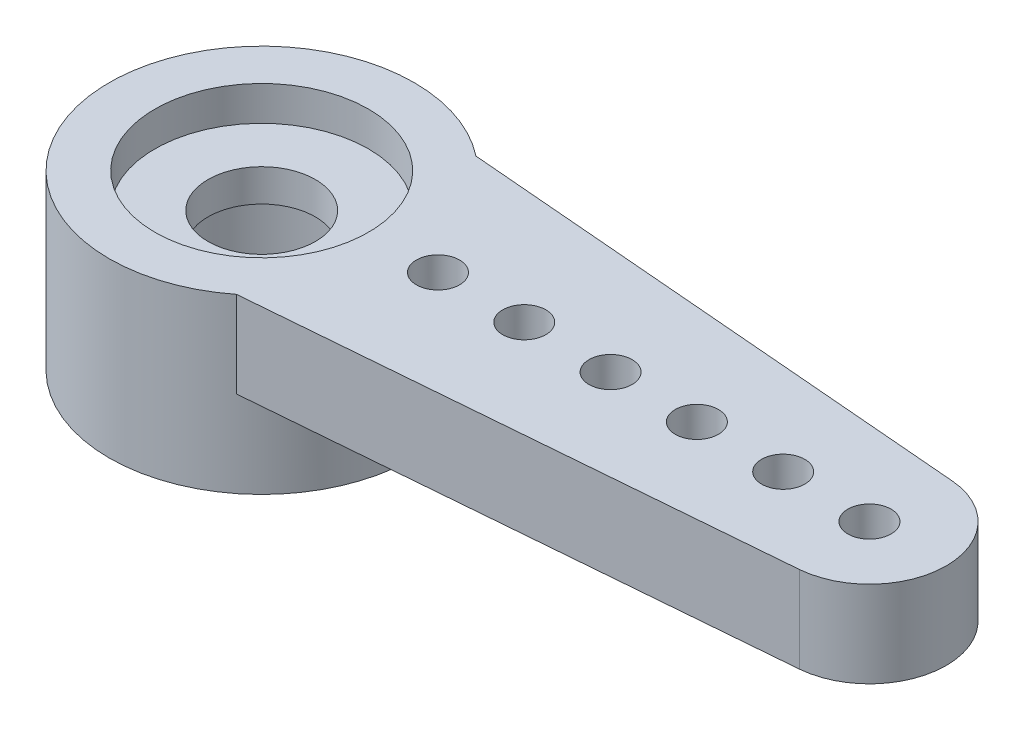
ISO-10303-21;
HEADER;
FILE_DESCRIPTION(('STEP AP214'),'2;1');
FILE_NAME('part.step','',(''),(''),'','','');
FILE_SCHEMA(('AUTOMOTIVE_DESIGN { 1 0 10303 214 1 1 1 1 }'));
ENDSEC;
DATA;
#1=APPLICATION_CONTEXT('core data for automotive mechanical design processes');
#2=APPLICATION_PROTOCOL_DEFINITION('international standard','automotive_design',2000,#1);
#3=PRODUCT_CONTEXT('',#1,'mechanical');
#4=PRODUCT('Part','Part','',(#3));
#5=PRODUCT_RELATED_PRODUCT_CATEGORY('part','',(#4));
#6=PRODUCT_DEFINITION_FORMATION('','',#4);
#7=PRODUCT_DEFINITION_CONTEXT('part definition',#1,'design');
#8=PRODUCT_DEFINITION('design','',#6,#7);
#9=PRODUCT_DEFINITION_SHAPE('','',#8);
#10=(LENGTH_UNIT() NAMED_UNIT(*) SI_UNIT(.MILLI.,.METRE.));
#11=(NAMED_UNIT(*) PLANE_ANGLE_UNIT() SI_UNIT($,.RADIAN.));
#12=(NAMED_UNIT(*) SI_UNIT($,.STERADIAN.) SOLID_ANGLE_UNIT());
#13=UNCERTAINTY_MEASURE_WITH_UNIT(LENGTH_MEASURE(1.E-05),#10,'distance_accuracy_value','');
#14=(GEOMETRIC_REPRESENTATION_CONTEXT(3) GLOBAL_UNCERTAINTY_ASSIGNED_CONTEXT((#13)) GLOBAL_UNIT_ASSIGNED_CONTEXT((#10,
#11,#12)) REPRESENTATION_CONTEXT('',''));
#15=CARTESIAN_POINT('',(0.,0.,0.));
#16=DIRECTION('',(0.,0.,1.));
#17=DIRECTION('',(1.,0.,0.));
#18=AXIS2_PLACEMENT_3D('',#15,#16,#17);
#19=CARTESIAN_POINT('',(0.,55.,0.));
#20=DIRECTION('',(0.,1.,0.));
#21=DIRECTION('',(0.,0.,1.));
#22=AXIS2_PLACEMENT_3D('',#19,#20,#21);
#23=CYLINDRICAL_SURFACE('',#22,3.535);
#24=CARTESIAN_POINT('',(0.,-2.,0.));
#25=DIRECTION('',(0.,1.,0.));
#26=DIRECTION('',(0.,0.,1.));
#27=AXIS2_PLACEMENT_3D('',#24,#25,#26);
#28=CIRCLE('',#27,3.535);
#29=CARTESIAN_POINT('',(0.,-2.,3.535));
#30=VERTEX_POINT('',#29);
#31=EDGE_CURVE('E151',#30,#30,#28,.T.);
#32=ORIENTED_EDGE('',*,*,#31,.T.);
#33=EDGE_LOOP('',(#32));
#34=FACE_BOUND('',#33,.T.);
#35=DIRECTION('',(0.,-1.,0.));
#36=VECTOR('',#35,1.);
#37=CARTESIAN_POINT('',(2.18988584177349,15.9538300204828,-2.775));
#38=LINE('',#37,#36);
#39=CARTESIAN_POINT('',(2.18988584177349,2.,-2.775));
#40=VERTEX_POINT('',#39);
#41=CARTESIAN_POINT('',(2.18988584177349,0.,-2.775));
#42=VERTEX_POINT('',#41);
#43=EDGE_CURVE('E97',#40,#42,#38,.T.);
#44=ORIENTED_EDGE('',*,*,#43,.T.);
#45=CARTESIAN_POINT('',(0.,0.,0.));
#46=DIRECTION('',(0.,1.,0.));
#47=DIRECTION('',(0.,0.,1.));
#48=AXIS2_PLACEMENT_3D('',#45,#46,#47);
#49=CIRCLE('',#48,3.535);
#50=CARTESIAN_POINT('',(2.18988584177349,0.,2.775));
#51=VERTEX_POINT('',#50);
#52=EDGE_CURVE('E102',#51,#42,#49,.T.);
#53=ORIENTED_EDGE('',*,*,#52,.F.);
#54=DIRECTION('',(0.,-1.,0.));
#55=VECTOR('',#54,1.);
#56=CARTESIAN_POINT('',(2.18988584177349,15.9538300204828,2.775));
#57=LINE('',#56,#55);
#58=CARTESIAN_POINT('',(2.18988584177349,2.,2.775));
#59=VERTEX_POINT('',#58);
#60=EDGE_CURVE('E111',#59,#51,#57,.T.);
#61=ORIENTED_EDGE('',*,*,#60,.F.);
#62=CARTESIAN_POINT('',(0.,2.,0.));
#63=DIRECTION('',(0.,1.,0.));
#64=DIRECTION('',(0.,0.,1.));
#65=AXIS2_PLACEMENT_3D('',#62,#63,#64);
#66=CIRCLE('',#65,3.535);
#67=EDGE_CURVE('E57',#40,#59,#66,.T.);
#68=ORIENTED_EDGE('',*,*,#67,.F.);
#69=EDGE_LOOP('',(#44,#53,#61,#68));
#70=FACE_BOUND('',#69,.T.);
#71=ADVANCED_FACE('F37',(#34,#70),#23,.T.);
#72=CARTESIAN_POINT('',(3.535,2.,0.));
#73=DIRECTION('',(0.,-1.,0.));
#74=DIRECTION('',(0.,0.,-1.));
#75=AXIS2_PLACEMENT_3D('',#72,#73,#74);
#76=PLANE('',#75);
#77=DIRECTION('',(-0.996562375684888,0.,-0.0828458289190973));
#78=VECTOR('',#77,1.);
#79=CARTESIAN_POINT('',(0.244137006312476,2.,-2.93675322195096));
#80=LINE('',#79,#78);
#81=CARTESIAN_POINT('',(14.232465575476,2.,-1.7738810287191));
#82=VERTEX_POINT('',#81);
#83=EDGE_CURVE('E96',#82,#40,#80,.T.);
#84=ORIENTED_EDGE('',*,*,#83,.T.);
#85=ORIENTED_EDGE('',*,*,#67,.T.);
#86=DIRECTION('',(-0.996562375684888,0.,0.0828458289190973));
#87=VECTOR('',#86,1.);
#88=CARTESIAN_POINT('',(0.244137006312476,2.,2.93675322195096));
#89=LINE('',#88,#87);
#90=CARTESIAN_POINT('',(14.232465575476,2.,1.7738810287191));
#91=VERTEX_POINT('',#90);
#92=EDGE_CURVE('E52',#91,#59,#89,.T.);
#93=ORIENTED_EDGE('',*,*,#92,.F.);
#94=CARTESIAN_POINT('',(14.085,2.,0.));
#95=DIRECTION('',(0.,-1.,0.));
#96=DIRECTION('',(0.,0.,-1.));
#97=AXIS2_PLACEMENT_3D('',#94,#95,#96);
#98=CIRCLE('',#97,1.78);
#99=EDGE_CURVE('E123',#82,#91,#98,.T.);
#100=ORIENTED_EDGE('',*,*,#99,.F.);
#101=EDGE_LOOP('',(#84,#85,#93,#100));
#102=FACE_BOUND('',#101,.T.);
#103=CARTESIAN_POINT('',(14.085,2.,0.));
#104=DIRECTION('',(0.,-1.,0.));
#105=DIRECTION('',(0.,0.,-1.));
#106=AXIS2_PLACEMENT_3D('',#103,#104,#105);
#107=CIRCLE('',#106,0.500000000000001);
#108=CARTESIAN_POINT('',(14.085,2.,-0.500000000000001));
#109=VERTEX_POINT('',#108);
#110=EDGE_CURVE('E120',#109,#109,#107,.T.);
#111=ORIENTED_EDGE('',*,*,#110,.T.);
#112=EDGE_LOOP('',(#111));
#113=FACE_BOUND('',#112,.T.);
#114=CARTESIAN_POINT('',(12.085,2.,0.));
#115=DIRECTION('',(0.,-1.,0.));
#116=DIRECTION('',(0.,0.,-1.));
#117=AXIS2_PLACEMENT_3D('',#114,#115,#116);
#118=CIRCLE('',#117,0.500000000000001);
#119=CARTESIAN_POINT('',(12.085,2.,-0.499999999999987));
#120=VERTEX_POINT('',#119);
#121=EDGE_CURVE('E117',#120,#120,#118,.T.);
#122=ORIENTED_EDGE('',*,*,#121,.T.);
#123=EDGE_LOOP('',(#122));
#124=FACE_BOUND('',#123,.T.);
#125=CARTESIAN_POINT('',(10.085,2.,0.));
#126=DIRECTION('',(0.,-1.,0.));
#127=DIRECTION('',(0.,0.,-1.));
#128=AXIS2_PLACEMENT_3D('',#125,#126,#127);
#129=CIRCLE('',#128,0.500000000000001);
#130=CARTESIAN_POINT('',(10.085,2.,-0.499999999999973));
#131=VERTEX_POINT('',#130);
#132=EDGE_CURVE('E114',#131,#131,#129,.T.);
#133=ORIENTED_EDGE('',*,*,#132,.T.);
#134=EDGE_LOOP('',(#133));
#135=FACE_BOUND('',#134,.T.);
#136=CARTESIAN_POINT('',(8.085,2.,0.));
#137=DIRECTION('',(0.,-1.,0.));
#138=DIRECTION('',(0.,0.,-1.));
#139=AXIS2_PLACEMENT_3D('',#136,#137,#138);
#140=CIRCLE('',#139,0.500000000000001);
#141=CARTESIAN_POINT('',(8.085,2.,-0.499999999999959));
#142=VERTEX_POINT('',#141);
#143=EDGE_CURVE('E110',#142,#142,#140,.T.);
#144=ORIENTED_EDGE('',*,*,#143,.T.);
#145=EDGE_LOOP('',(#144));
#146=FACE_BOUND('',#145,.T.);
#147=CARTESIAN_POINT('',(6.085,2.,0.));
#148=DIRECTION('',(0.,-1.,0.));
#149=DIRECTION('',(0.,0.,-1.));
#150=AXIS2_PLACEMENT_3D('',#147,#148,#149);
#151=CIRCLE('',#150,0.500000000000001);
#152=CARTESIAN_POINT('',(6.085,2.,-0.499999999999945));
#153=VERTEX_POINT('',#152);
#154=EDGE_CURVE('E107',#153,#153,#151,.T.);
#155=ORIENTED_EDGE('',*,*,#154,.T.);
#156=EDGE_LOOP('',(#155));
#157=FACE_BOUND('',#156,.T.);
#158=CARTESIAN_POINT('',(0.,2.,0.));
#159=DIRECTION('',(0.,1.,0.));
#160=DIRECTION('',(0.,0.,1.));
#161=AXIS2_PLACEMENT_3D('',#158,#159,#160);
#162=CIRCLE('',#161,2.475);
#163=CARTESIAN_POINT('',(0.,2.,2.475));
#164=VERTEX_POINT('',#163);
#165=EDGE_CURVE('E11',#164,#164,#162,.T.);
#166=ORIENTED_EDGE('',*,*,#165,.F.);
#167=EDGE_LOOP('',(#166));
#168=FACE_BOUND('',#167,.T.);
#169=CARTESIAN_POINT('',(4.085,2.,0.));
#170=DIRECTION('',(0.,-1.,0.));
#171=DIRECTION('',(0.,0.,-1.));
#172=AXIS2_PLACEMENT_3D('',#169,#170,#171);
#173=CIRCLE('',#172,0.500000000000001);
#174=CARTESIAN_POINT('',(4.085,2.,-0.499999999999931));
#175=VERTEX_POINT('',#174);
#176=EDGE_CURVE('E126',#175,#175,#173,.T.);
#177=ORIENTED_EDGE('',*,*,#176,.T.);
#178=EDGE_LOOP('',(#177));
#179=FACE_BOUND('',#178,.T.);
#180=ADVANCED_FACE('F39',(#102,#113,#124,#135,#146,#157,#168,#179),#76,.F.);
#181=CARTESIAN_POINT('',(0.,55.,0.));
#182=DIRECTION('',(0.,1.,0.));
#183=DIRECTION('',(0.,0.,1.));
#184=AXIS2_PLACEMENT_3D('',#181,#182,#183);
#185=CYLINDRICAL_SURFACE('',#184,2.475);
#186=CARTESIAN_POINT('',(0.,1.2,0.));
#187=DIRECTION('',(0.,1.,0.));
#188=DIRECTION('',(0.,0.,1.));
#189=AXIS2_PLACEMENT_3D('',#186,#187,#188);
#190=CIRCLE('',#189,2.475);
#191=CARTESIAN_POINT('',(0.,1.2,2.475));
#192=VERTEX_POINT('',#191);
#193=EDGE_CURVE('E45',#192,#192,#190,.T.);
#194=ORIENTED_EDGE('',*,*,#193,.F.);
#195=EDGE_LOOP('',(#194));
#196=FACE_BOUND('',#195,.T.);
#197=ORIENTED_EDGE('',*,*,#165,.T.);
#198=EDGE_LOOP('',(#197));
#199=FACE_BOUND('',#198,.T.);
#200=ADVANCED_FACE('F170',(#196,#199),#185,.F.);
#201=CARTESIAN_POINT('',(2.475,1.2,0.));
#202=DIRECTION('',(0.,-1.,0.));
#203=DIRECTION('',(0.,0.,-1.));
#204=AXIS2_PLACEMENT_3D('',#201,#202,#203);
#205=PLANE('',#204);
#206=CARTESIAN_POINT('',(0.,1.2,0.));
#207=DIRECTION('',(0.,1.,0.));
#208=DIRECTION('',(0.,0.,1.));
#209=AXIS2_PLACEMENT_3D('',#206,#207,#208);
#210=CIRCLE('',#209,1.245);
#211=CARTESIAN_POINT('',(0.,1.2,1.245));
#212=VERTEX_POINT('',#211);
#213=EDGE_CURVE('E163',#212,#212,#210,.T.);
#214=ORIENTED_EDGE('',*,*,#213,.F.);
#215=EDGE_LOOP('',(#214));
#216=FACE_BOUND('',#215,.T.);
#217=ORIENTED_EDGE('',*,*,#193,.T.);
#218=EDGE_LOOP('',(#217));
#219=FACE_BOUND('',#218,.T.);
#220=ADVANCED_FACE('F168',(#216,#219),#205,.F.);
#221=CARTESIAN_POINT('',(0.,55.,0.));
#222=DIRECTION('',(0.,1.,0.));
#223=DIRECTION('',(0.,0.,1.));
#224=AXIS2_PLACEMENT_3D('',#221,#222,#223);
#225=CYLINDRICAL_SURFACE('',#224,1.245);
#226=CARTESIAN_POINT('',(0.,0.449999999999999,0.));
#227=DIRECTION('',(0.,1.,0.));
#228=DIRECTION('',(0.,0.,1.));
#229=AXIS2_PLACEMENT_3D('',#226,#227,#228);
#230=CIRCLE('',#229,1.245);
#231=CARTESIAN_POINT('',(0.,0.449999999999999,1.245));
#232=VERTEX_POINT('',#231);
#233=EDGE_CURVE('E160',#232,#232,#230,.T.);
#234=ORIENTED_EDGE('',*,*,#233,.F.);
#235=EDGE_LOOP('',(#234));
#236=FACE_BOUND('',#235,.T.);
#237=ORIENTED_EDGE('',*,*,#213,.T.);
#238=EDGE_LOOP('',(#237));
#239=FACE_BOUND('',#238,.T.);
#240=ADVANCED_FACE('F211',(#236,#239),#225,.F.);
#241=CARTESIAN_POINT('',(1.245,0.45,0.));
#242=DIRECTION('',(0.,1.,0.));
#243=DIRECTION('',(0.,0.,1.));
#244=AXIS2_PLACEMENT_3D('',#241,#242,#243);
#245=PLANE('',#244);
#246=CARTESIAN_POINT('',(0.,0.449999999999999,0.));
#247=DIRECTION('',(0.,1.,0.));
#248=DIRECTION('',(0.,0.,1.));
#249=AXIS2_PLACEMENT_3D('',#246,#247,#248);
#250=CIRCLE('',#249,2.375);
#251=CARTESIAN_POINT('',(0.,0.449999999999999,2.375));
#252=VERTEX_POINT('',#251);
#253=EDGE_CURVE('E157',#252,#252,#250,.T.);
#254=ORIENTED_EDGE('',*,*,#253,.F.);
#255=EDGE_LOOP('',(#254));
#256=FACE_BOUND('',#255,.T.);
#257=ORIENTED_EDGE('',*,*,#233,.T.);
#258=EDGE_LOOP('',(#257));
#259=FACE_BOUND('',#258,.T.);
#260=ADVANCED_FACE('F207',(#256,#259),#245,.F.);
#261=CARTESIAN_POINT('',(0.,55.,0.));
#262=DIRECTION('',(0.,1.,0.));
#263=DIRECTION('',(0.,0.,1.));
#264=AXIS2_PLACEMENT_3D('',#261,#262,#263);
#265=CYLINDRICAL_SURFACE('',#264,2.375);
#266=CARTESIAN_POINT('',(0.,-2.,0.));
#267=DIRECTION('',(0.,1.,0.));
#268=DIRECTION('',(0.,0.,1.));
#269=AXIS2_PLACEMENT_3D('',#266,#267,#268);
#270=CIRCLE('',#269,2.375);
#271=CARTESIAN_POINT('',(0.,-2.,2.375));
#272=VERTEX_POINT('',#271);
#273=EDGE_CURVE('E154',#272,#272,#270,.T.);
#274=ORIENTED_EDGE('',*,*,#273,.F.);
#275=EDGE_LOOP('',(#274));
#276=FACE_BOUND('',#275,.T.);
#277=ORIENTED_EDGE('',*,*,#253,.T.);
#278=EDGE_LOOP('',(#277));
#279=FACE_BOUND('',#278,.T.);
#280=ADVANCED_FACE('F192',(#276,#279),#265,.F.);
#281=CARTESIAN_POINT('',(2.375,-2.,0.));
#282=DIRECTION('',(0.,1.,0.));
#283=DIRECTION('',(0.,0.,1.));
#284=AXIS2_PLACEMENT_3D('',#281,#282,#283);
#285=PLANE('',#284);
#286=ORIENTED_EDGE('',*,*,#31,.F.);
#287=EDGE_LOOP('',(#286));
#288=FACE_BOUND('',#287,.T.);
#289=ORIENTED_EDGE('',*,*,#273,.T.);
#290=EDGE_LOOP('',(#289));
#291=FACE_BOUND('',#290,.T.);
#292=ADVANCED_FACE('F182',(#288,#291),#285,.F.);
#293=CARTESIAN_POINT('',(4.085,15.9538300204828,0.));
#294=DIRECTION('',(0.,-1.,0.));
#295=DIRECTION('',(0.,0.,-1.));
#296=AXIS2_PLACEMENT_3D('',#293,#294,#295);
#297=CYLINDRICAL_SURFACE('',#296,0.500000000000001);
#298=CARTESIAN_POINT('',(4.085,0.,0.));
#299=DIRECTION('',(0.,1.,0.));
#300=DIRECTION('',(0.,0.,1.));
#301=AXIS2_PLACEMENT_3D('',#298,#299,#300);
#302=CIRCLE('',#301,0.500000000000001);
#303=CARTESIAN_POINT('',(4.085,0.,0.500000000000071));
#304=VERTEX_POINT('',#303);
#305=EDGE_CURVE('E129',#304,#304,#302,.T.);
#306=ORIENTED_EDGE('',*,*,#305,.F.);
#307=EDGE_LOOP('',(#306));
#308=FACE_BOUND('',#307,.T.);
#309=ORIENTED_EDGE('',*,*,#176,.F.);
#310=EDGE_LOOP('',(#309));
#311=FACE_BOUND('',#310,.T.);
#312=ADVANCED_FACE('F179',(#308,#311),#297,.F.);
#313=CARTESIAN_POINT('',(0.244137006312476,15.9538300204828,2.93675322195096));
#314=DIRECTION('',(-0.0828458289190973,0.,-0.996562375684888));
#315=DIRECTION('',(-0.996562375684888,0.,0.0828458289190973));
#316=AXIS2_PLACEMENT_3D('',#313,#314,#315);
#317=PLANE('',#316);
#318=DIRECTION('',(0.,-1.,0.));
#319=VECTOR('',#318,1.);
#320=CARTESIAN_POINT('',(14.232465575476,15.9538300204828,1.7738810287191));
#321=LINE('',#320,#319);
#322=CARTESIAN_POINT('',(14.232465575476,0.,1.7738810287191));
#323=VERTEX_POINT('',#322);
#324=EDGE_CURVE('E82',#91,#323,#321,.T.);
#325=ORIENTED_EDGE('',*,*,#324,.F.);
#326=ORIENTED_EDGE('',*,*,#92,.T.);
#327=ORIENTED_EDGE('',*,*,#60,.T.);
#328=DIRECTION('',(0.996562375684888,0.,-0.0828458289190973));
#329=VECTOR('',#328,1.);
#330=CARTESIAN_POINT('',(0.244137006312476,0.,2.93675322195096));
#331=LINE('',#330,#329);
#332=EDGE_CURVE('E88',#51,#323,#331,.T.);
#333=ORIENTED_EDGE('',*,*,#332,.T.);
#334=EDGE_LOOP('',(#325,#326,#327,#333));
#335=FACE_BOUND('',#334,.T.);
#336=ADVANCED_FACE('F181',(#335),#317,.F.);
#337=CARTESIAN_POINT('',(14.085,15.9538300204828,0.));
#338=DIRECTION('',(0.,-1.,0.));
#339=DIRECTION('',(0.,0.,-1.));
#340=AXIS2_PLACEMENT_3D('',#337,#338,#339);
#341=CYLINDRICAL_SURFACE('',#340,1.78);
#342=CARTESIAN_POINT('',(14.085,0.,0.));
#343=DIRECTION('',(0.,1.,0.));
#344=DIRECTION('',(0.,0.,1.));
#345=AXIS2_PLACEMENT_3D('',#342,#343,#344);
#346=CIRCLE('',#345,1.78);
#347=CARTESIAN_POINT('',(14.232465575476,0.,-1.7738810287191));
#348=VERTEX_POINT('',#347);
#349=EDGE_CURVE('E76',#323,#348,#346,.T.);
#350=ORIENTED_EDGE('',*,*,#349,.T.);
#351=DIRECTION('',(0.,-1.,0.));
#352=VECTOR('',#351,1.);
#353=CARTESIAN_POINT('',(14.232465575476,15.9538300204828,-1.7738810287191));
#354=LINE('',#353,#352);
#355=EDGE_CURVE('E79',#82,#348,#354,.T.);
#356=ORIENTED_EDGE('',*,*,#355,.F.);
#357=ORIENTED_EDGE('',*,*,#99,.T.);
#358=ORIENTED_EDGE('',*,*,#324,.T.);
#359=EDGE_LOOP('',(#350,#356,#357,#358));
#360=FACE_BOUND('',#359,.T.);
#361=ADVANCED_FACE('F78',(#360),#341,.T.);
#362=CARTESIAN_POINT('',(14.085,15.9538300204828,0.));
#363=DIRECTION('',(0.,-1.,0.));
#364=DIRECTION('',(0.,0.,-1.));
#365=AXIS2_PLACEMENT_3D('',#362,#363,#364);
#366=CYLINDRICAL_SURFACE('',#365,0.500000000000001);
#367=CARTESIAN_POINT('',(14.085,0.,0.));
#368=DIRECTION('',(0.,1.,0.));
#369=DIRECTION('',(0.,0.,1.));
#370=AXIS2_PLACEMENT_3D('',#367,#368,#369);
#371=CIRCLE('',#370,0.500000000000001);
#372=CARTESIAN_POINT('',(14.085,0.,0.500000000000001));
#373=VERTEX_POINT('',#372);
#374=EDGE_CURVE('E87',#373,#373,#371,.T.);
#375=ORIENTED_EDGE('',*,*,#374,.F.);
#376=EDGE_LOOP('',(#375));
#377=FACE_BOUND('',#376,.T.);
#378=ORIENTED_EDGE('',*,*,#110,.F.);
#379=EDGE_LOOP('',(#378));
#380=FACE_BOUND('',#379,.T.);
#381=ADVANCED_FACE('F265',(#377,#380),#366,.F.);
#382=CARTESIAN_POINT('',(12.085,15.9538300204828,0.));
#383=DIRECTION('',(0.,-1.,0.));
#384=DIRECTION('',(0.,0.,-1.));
#385=AXIS2_PLACEMENT_3D('',#382,#383,#384);
#386=CYLINDRICAL_SURFACE('',#385,0.500000000000001);
#387=CARTESIAN_POINT('',(12.085,0.,0.));
#388=DIRECTION('',(0.,1.,0.));
#389=DIRECTION('',(0.,0.,1.));
#390=AXIS2_PLACEMENT_3D('',#387,#388,#389);
#391=CIRCLE('',#390,0.500000000000001);
#392=CARTESIAN_POINT('',(12.085,0.,0.500000000000015));
#393=VERTEX_POINT('',#392);
#394=EDGE_CURVE('E136',#393,#393,#391,.T.);
#395=ORIENTED_EDGE('',*,*,#394,.F.);
#396=EDGE_LOOP('',(#395));
#397=FACE_BOUND('',#396,.T.);
#398=ORIENTED_EDGE('',*,*,#121,.F.);
#399=EDGE_LOOP('',(#398));
#400=FACE_BOUND('',#399,.T.);
#401=ADVANCED_FACE('F275',(#397,#400),#386,.F.);
#402=CARTESIAN_POINT('',(10.085,15.9538300204828,0.));
#403=DIRECTION('',(0.,-1.,0.));
#404=DIRECTION('',(0.,0.,-1.));
#405=AXIS2_PLACEMENT_3D('',#402,#403,#404);
#406=CYLINDRICAL_SURFACE('',#405,0.500000000000001);
#407=CARTESIAN_POINT('',(10.085,0.,0.));
#408=DIRECTION('',(0.,1.,0.));
#409=DIRECTION('',(0.,0.,1.));
#410=AXIS2_PLACEMENT_3D('',#407,#408,#409);
#411=CIRCLE('',#410,0.500000000000001);
#412=CARTESIAN_POINT('',(10.085,0.,0.500000000000029));
#413=VERTEX_POINT('',#412);
#414=EDGE_CURVE('E139',#413,#413,#411,.T.);
#415=ORIENTED_EDGE('',*,*,#414,.F.);
#416=EDGE_LOOP('',(#415));
#417=FACE_BOUND('',#416,.T.);
#418=ORIENTED_EDGE('',*,*,#132,.F.);
#419=EDGE_LOOP('',(#418));
#420=FACE_BOUND('',#419,.T.);
#421=ADVANCED_FACE('F286',(#417,#420),#406,.F.);
#422=CARTESIAN_POINT('',(8.085,15.9538300204828,0.));
#423=DIRECTION('',(0.,-1.,0.));
#424=DIRECTION('',(0.,0.,-1.));
#425=AXIS2_PLACEMENT_3D('',#422,#423,#424);
#426=CYLINDRICAL_SURFACE('',#425,0.500000000000001);
#427=CARTESIAN_POINT('',(8.085,0.,0.));
#428=DIRECTION('',(0.,1.,0.));
#429=DIRECTION('',(0.,0.,1.));
#430=AXIS2_PLACEMENT_3D('',#427,#428,#429);
#431=CIRCLE('',#430,0.500000000000001);
#432=CARTESIAN_POINT('',(8.085,0.,0.500000000000043));
#433=VERTEX_POINT('',#432);
#434=EDGE_CURVE('E142',#433,#433,#431,.T.);
#435=ORIENTED_EDGE('',*,*,#434,.F.);
#436=EDGE_LOOP('',(#435));
#437=FACE_BOUND('',#436,.T.);
#438=ORIENTED_EDGE('',*,*,#143,.F.);
#439=EDGE_LOOP('',(#438));
#440=FACE_BOUND('',#439,.T.);
#441=ADVANCED_FACE('F297',(#437,#440),#426,.F.);
#442=CARTESIAN_POINT('',(6.085,15.9538300204828,0.));
#443=DIRECTION('',(0.,-1.,0.));
#444=DIRECTION('',(0.,0.,-1.));
#445=AXIS2_PLACEMENT_3D('',#442,#443,#444);
#446=CYLINDRICAL_SURFACE('',#445,0.500000000000001);
#447=CARTESIAN_POINT('',(6.085,0.,0.));
#448=DIRECTION('',(0.,1.,0.));
#449=DIRECTION('',(0.,0.,1.));
#450=AXIS2_PLACEMENT_3D('',#447,#448,#449);
#451=CIRCLE('',#450,0.500000000000001);
#452=CARTESIAN_POINT('',(6.085,0.,0.500000000000057));
#453=VERTEX_POINT('',#452);
#454=EDGE_CURVE('E145',#453,#453,#451,.T.);
#455=ORIENTED_EDGE('',*,*,#454,.F.);
#456=EDGE_LOOP('',(#455));
#457=FACE_BOUND('',#456,.T.);
#458=ORIENTED_EDGE('',*,*,#154,.F.);
#459=EDGE_LOOP('',(#458));
#460=FACE_BOUND('',#459,.T.);
#461=ADVANCED_FACE('F308',(#457,#460),#446,.F.);
#462=CARTESIAN_POINT('',(0.,0.,0.));
#463=DIRECTION('',(0.,1.,0.));
#464=DIRECTION('',(0.,0.,1.));
#465=AXIS2_PLACEMENT_3D('',#462,#463,#464);
#466=PLANE('',#465);
#467=ORIENTED_EDGE('',*,*,#305,.T.);
#468=EDGE_LOOP('',(#467));
#469=FACE_BOUND('',#468,.T.);
#470=DIRECTION('',(0.996562375684888,0.,0.0828458289190973));
#471=VECTOR('',#470,1.);
#472=CARTESIAN_POINT('',(0.244137006312476,0.,-2.93675322195096));
#473=LINE('',#472,#471);
#474=EDGE_CURVE('E94',#42,#348,#473,.T.);
#475=ORIENTED_EDGE('',*,*,#474,.T.);
#476=ORIENTED_EDGE('',*,*,#349,.F.);
#477=ORIENTED_EDGE('',*,*,#332,.F.);
#478=ORIENTED_EDGE('',*,*,#52,.T.);
#479=EDGE_LOOP('',(#475,#476,#477,#478));
#480=FACE_BOUND('',#479,.T.);
#481=ORIENTED_EDGE('',*,*,#374,.T.);
#482=EDGE_LOOP('',(#481));
#483=FACE_BOUND('',#482,.T.);
#484=ORIENTED_EDGE('',*,*,#394,.T.);
#485=EDGE_LOOP('',(#484));
#486=FACE_BOUND('',#485,.T.);
#487=ORIENTED_EDGE('',*,*,#414,.T.);
#488=EDGE_LOOP('',(#487));
#489=FACE_BOUND('',#488,.T.);
#490=ORIENTED_EDGE('',*,*,#434,.T.);
#491=EDGE_LOOP('',(#490));
#492=FACE_BOUND('',#491,.T.);
#493=ORIENTED_EDGE('',*,*,#454,.T.);
#494=EDGE_LOOP('',(#493));
#495=FACE_BOUND('',#494,.T.);
#496=ADVANCED_FACE('F99',(#469,#480,#483,#486,#489,#492,#495),#466,.F.);
#497=CARTESIAN_POINT('',(0.244137006312476,15.9538300204828,-2.93675322195096));
#498=DIRECTION('',(0.0828458289190973,0.,-0.996562375684888));
#499=DIRECTION('',(-0.996562375684888,0.,-0.0828458289190973));
#500=AXIS2_PLACEMENT_3D('',#497,#498,#499);
#501=PLANE('',#500);
#502=ORIENTED_EDGE('',*,*,#83,.F.);
#503=ORIENTED_EDGE('',*,*,#355,.T.);
#504=ORIENTED_EDGE('',*,*,#474,.F.);
#505=ORIENTED_EDGE('',*,*,#43,.F.);
#506=EDGE_LOOP('',(#502,#503,#504,#505));
#507=FACE_BOUND('',#506,.T.);
#508=ADVANCED_FACE('F92',(#507),#501,.T.);
#509=CLOSED_SHELL('',(#71,#180,#200,#220,#240,#260,#280,#292,#312,#336,#361,#381,#401,#421,#441,
#461,#496,#508));
#510=MANIFOLD_SOLID_BREP('B2',#509);
#511=ADVANCED_BREP_SHAPE_REPRESENTATION('',(#18,#510),#14);
#512=SHAPE_DEFINITION_REPRESENTATION(#9,#511);
ENDSEC;
END-ISO-10303-21;
